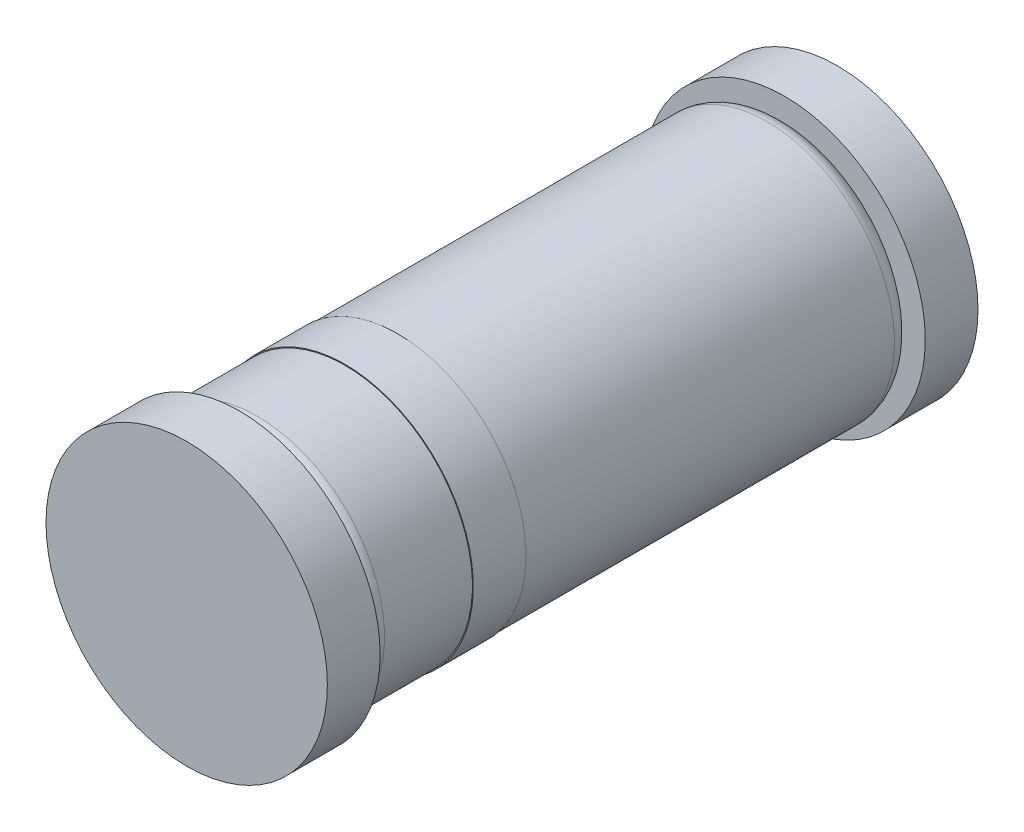
ISO-10303-21;
HEADER;
FILE_DESCRIPTION(('STEP AP214'),'2;1');
FILE_NAME('part.step','',(''),(''),'','','');
FILE_SCHEMA(('AUTOMOTIVE_DESIGN { 1 0 10303 214 1 1 1 1 }'));
ENDSEC;
DATA;
#1=APPLICATION_CONTEXT('core data for automotive mechanical design processes');
#2=APPLICATION_PROTOCOL_DEFINITION('international standard','automotive_design',2000,#1);
#3=PRODUCT_CONTEXT('',#1,'mechanical');
#4=PRODUCT('Part','Part','',(#3));
#5=PRODUCT_RELATED_PRODUCT_CATEGORY('part','',(#4));
#6=PRODUCT_DEFINITION_FORMATION('','',#4);
#7=PRODUCT_DEFINITION_CONTEXT('part definition',#1,'design');
#8=PRODUCT_DEFINITION('design','',#6,#7);
#9=PRODUCT_DEFINITION_SHAPE('','',#8);
#10=(LENGTH_UNIT() NAMED_UNIT(*) SI_UNIT(.MILLI.,.METRE.));
#11=(NAMED_UNIT(*) PLANE_ANGLE_UNIT() SI_UNIT($,.RADIAN.));
#12=(NAMED_UNIT(*) SI_UNIT($,.STERADIAN.) SOLID_ANGLE_UNIT());
#13=UNCERTAINTY_MEASURE_WITH_UNIT(LENGTH_MEASURE(1.E-05),#10,'distance_accuracy_value','');
#14=(GEOMETRIC_REPRESENTATION_CONTEXT(3) GLOBAL_UNCERTAINTY_ASSIGNED_CONTEXT((#13)) GLOBAL_UNIT_ASSIGNED_CONTEXT((#10,
#11,#12)) REPRESENTATION_CONTEXT('',''));
#15=CARTESIAN_POINT('',(0.,0.,0.));
#16=DIRECTION('',(0.,0.,1.));
#17=DIRECTION('',(1.,0.,0.));
#18=AXIS2_PLACEMENT_3D('',#15,#16,#17);
#19=CARTESIAN_POINT('',(0.,0.,-3.4));
#20=DIRECTION('',(0.,0.,1.));
#21=DIRECTION('',(1.,0.,0.));
#22=AXIS2_PLACEMENT_3D('',#19,#20,#21);
#23=PLANE('',#22);
#24=CARTESIAN_POINT('',(0.,0.,-3.4));
#25=DIRECTION('',(0.,0.,-1.));
#26=DIRECTION('',(-1.,0.,0.));
#27=AXIS2_PLACEMENT_3D('',#24,#25,#26);
#28=CIRCLE('',#27,0.8);
#29=CARTESIAN_POINT('',(-0.8,0.,-3.4));
#30=VERTEX_POINT('',#29);
#31=EDGE_CURVE('P0_E17',#30,#30,#28,.T.);
#32=ORIENTED_EDGE('',*,*,#31,.F.);
#33=EDGE_LOOP('',(#32));
#34=FACE_BOUND('',#33,.T.);
#35=ADVANCED_FACE('P0_F14',(#34),#23,.T.);
#36=CARTESIAN_POINT('',(0.,0.,-3.4));
#37=DIRECTION('',(0.,0.,-1.));
#38=DIRECTION('',(-1.,0.,0.));
#39=AXIS2_PLACEMENT_3D('',#36,#37,#38);
#40=CYLINDRICAL_SURFACE('',#39,0.8);
#41=ORIENTED_EDGE('',*,*,#31,.T.);
#42=EDGE_LOOP('',(#41));
#43=FACE_BOUND('',#42,.T.);
#44=CARTESIAN_POINT('',(0.,0.,-3.7));
#45=DIRECTION('',(0.,0.,-1.));
#46=DIRECTION('',(-1.,0.,0.));
#47=AXIS2_PLACEMENT_3D('',#44,#45,#46);
#48=CIRCLE('',#47,0.8);
#49=CARTESIAN_POINT('',(-0.8,0.,-3.7));
#50=VERTEX_POINT('',#49);
#51=EDGE_CURVE('P0_E9',#50,#50,#48,.F.);
#52=ORIENTED_EDGE('',*,*,#51,.T.);
#53=EDGE_LOOP('',(#52));
#54=FACE_BOUND('',#53,.T.);
#55=ADVANCED_FACE('P0_F26',(#43,#54),#40,.T.);
#56=CARTESIAN_POINT('',(0.,0.,-3.7));
#57=DIRECTION('',(0.,0.,1.));
#58=DIRECTION('',(1.,0.,0.));
#59=AXIS2_PLACEMENT_3D('',#56,#57,#58);
#60=PLANE('',#59);
#61=ORIENTED_EDGE('',*,*,#51,.F.);
#62=EDGE_LOOP('',(#61));
#63=FACE_BOUND('',#62,.T.);
#64=ADVANCED_FACE('P0_F33',(#63),#60,.F.);
#65=CLOSED_SHELL('',(#35,#55,#64));
#66=MANIFOLD_SOLID_BREP('P0_B1',#65);
#67=CARTESIAN_POINT('',(0.,0.,-0.3));
#68=DIRECTION('',(0.,0.,1.));
#69=DIRECTION('',(1.,0.,0.));
#70=AXIS2_PLACEMENT_3D('',#67,#68,#69);
#71=PLANE('',#70);
#72=CARTESIAN_POINT('',(0.,0.,-0.3));
#73=DIRECTION('',(0.,0.,-1.));
#74=DIRECTION('',(-1.,0.,0.));
#75=AXIS2_PLACEMENT_3D('',#72,#73,#74);
#76=CIRCLE('',#75,0.625);
#77=CARTESIAN_POINT('',(-0.625,0.,-0.3));
#78=VERTEX_POINT('',#77);
#79=EDGE_CURVE('P1_E66',#78,#78,#76,.T.);
#80=ORIENTED_EDGE('',*,*,#79,.F.);
#81=EDGE_LOOP('',(#80));
#82=FACE_BOUND('',#81,.T.);
#83=ADVANCED_FACE('P1_F15',(#82),#71,.T.);
#84=CARTESIAN_POINT('',(0.,0.,-3.4));
#85=DIRECTION('',(0.,0.,1.));
#86=DIRECTION('',(1.,0.,0.));
#87=AXIS2_PLACEMENT_3D('',#84,#85,#86);
#88=PLANE('',#87);
#89=CARTESIAN_POINT('',(0.,0.,-3.4));
#90=DIRECTION('',(0.,0.,1.));
#91=DIRECTION('',(-1.,0.,0.));
#92=AXIS2_PLACEMENT_3D('',#89,#90,#91);
#93=CIRCLE('',#92,0.625);
#94=CARTESIAN_POINT('',(-0.625,0.,-3.4));
#95=VERTEX_POINT('',#94);
#96=EDGE_CURVE('P1_E30',#95,#95,#93,.T.);
#97=ORIENTED_EDGE('',*,*,#96,.F.);
#98=EDGE_LOOP('',(#97));
#99=FACE_BOUND('',#98,.T.);
#100=ADVANCED_FACE('P1_F79',(#99),#88,.F.);
#101=CARTESIAN_POINT('',(0.,0.,-0.4));
#102=DIRECTION('',(0.,0.,1.));
#103=DIRECTION('',(1.,0.,0.));
#104=AXIS2_PLACEMENT_3D('',#101,#102,#103);
#105=TOROIDAL_SURFACE('',#104,0.625,0.1);
#106=ORIENTED_EDGE('',*,*,#79,.T.);
#107=EDGE_LOOP('',(#106));
#108=FACE_BOUND('',#107,.T.);
#109=CARTESIAN_POINT('',(0.,0.,-0.4));
#110=DIRECTION('',(0.,0.,-1.));
#111=DIRECTION('',(-1.,0.,0.));
#112=AXIS2_PLACEMENT_3D('',#109,#110,#111);
#113=CIRCLE('',#112,0.725);
#114=CARTESIAN_POINT('',(-0.725,0.,-0.4));
#115=VERTEX_POINT('',#114);
#116=EDGE_CURVE('P1_E25',#115,#115,#113,.T.);
#117=ORIENTED_EDGE('',*,*,#116,.F.);
#118=EDGE_LOOP('',(#117));
#119=FACE_BOUND('',#118,.T.);
#120=ADVANCED_FACE('P1_F47',(#108,#119),#105,.T.);
#121=CARTESIAN_POINT('',(0.,0.,-3.3));
#122=DIRECTION('',(0.,0.,-1.));
#123=DIRECTION('',(-1.,0.,0.));
#124=AXIS2_PLACEMENT_3D('',#121,#122,#123);
#125=TOROIDAL_SURFACE('',#124,0.625,0.1);
#126=ORIENTED_EDGE('',*,*,#96,.T.);
#127=EDGE_LOOP('',(#126));
#128=FACE_BOUND('',#127,.T.);
#129=CARTESIAN_POINT('',(0.,0.,-3.3));
#130=DIRECTION('',(0.,0.,-1.));
#131=DIRECTION('',(-1.,0.,0.));
#132=AXIS2_PLACEMENT_3D('',#129,#130,#131);
#133=CIRCLE('',#132,0.725);
#134=CARTESIAN_POINT('',(-0.725,0.,-3.3));
#135=VERTEX_POINT('',#134);
#136=EDGE_CURVE('P1_E10',#135,#135,#133,.F.);
#137=ORIENTED_EDGE('',*,*,#136,.F.);
#138=EDGE_LOOP('',(#137));
#139=FACE_BOUND('',#138,.T.);
#140=ADVANCED_FACE('P1_F42',(#128,#139),#125,.T.);
#141=CARTESIAN_POINT('',(0.,0.,-0.3));
#142=DIRECTION('',(0.,0.,-1.));
#143=DIRECTION('',(-1.,0.,0.));
#144=AXIS2_PLACEMENT_3D('',#141,#142,#143);
#145=CYLINDRICAL_SURFACE('',#144,0.725);
#146=ORIENTED_EDGE('',*,*,#136,.T.);
#147=EDGE_LOOP('',(#146));
#148=FACE_BOUND('',#147,.T.);
#149=ORIENTED_EDGE('',*,*,#116,.T.);
#150=EDGE_LOOP('',(#149));
#151=FACE_BOUND('',#150,.T.);
#152=ADVANCED_FACE('P1_F46',(#148,#151),#145,.T.);
#153=CLOSED_SHELL('',(#83,#100,#120,#140,#152));
#154=MANIFOLD_SOLID_BREP('P1_B1',#153);
#155=CARTESIAN_POINT('',(0.,0.,-0.9));
#156=DIRECTION('',(0.,0.,1.));
#157=DIRECTION('',(1.,0.,0.));
#158=AXIS2_PLACEMENT_3D('',#155,#156,#157);
#159=PLANE('',#158);
#160=CARTESIAN_POINT('',(0.,0.,-0.9));
#161=DIRECTION('',(0.,0.,-1.));
#162=DIRECTION('',(-1.,0.,0.));
#163=AXIS2_PLACEMENT_3D('',#160,#161,#162);
#164=CIRCLE('',#163,0.73);
#165=CARTESIAN_POINT('',(-0.73,0.,-0.9));
#166=VERTEX_POINT('',#165);
#167=EDGE_CURVE('P2_E18',#166,#166,#164,.T.);
#168=ORIENTED_EDGE('',*,*,#167,.F.);
#169=EDGE_LOOP('',(#168));
#170=FACE_BOUND('',#169,.T.);
#171=ADVANCED_FACE('P2_F15',(#170),#159,.T.);
#172=CARTESIAN_POINT('',(0.,0.,-0.9));
#173=DIRECTION('',(0.,0.,-1.));
#174=DIRECTION('',(-1.,0.,0.));
#175=AXIS2_PLACEMENT_3D('',#172,#173,#174);
#176=CYLINDRICAL_SURFACE('',#175,0.73);
#177=ORIENTED_EDGE('',*,*,#167,.T.);
#178=EDGE_LOOP('',(#177));
#179=FACE_BOUND('',#178,.T.);
#180=CARTESIAN_POINT('',(0.,0.,-1.2));
#181=DIRECTION('',(0.,0.,-1.));
#182=DIRECTION('',(-1.,0.,0.));
#183=AXIS2_PLACEMENT_3D('',#180,#181,#182);
#184=CIRCLE('',#183,0.73);
#185=CARTESIAN_POINT('',(-0.73,0.,-1.2));
#186=VERTEX_POINT('',#185);
#187=EDGE_CURVE('P2_E10',#186,#186,#184,.F.);
#188=ORIENTED_EDGE('',*,*,#187,.T.);
#189=EDGE_LOOP('',(#188));
#190=FACE_BOUND('',#189,.T.);
#191=ADVANCED_FACE('P2_F27',(#179,#190),#176,.T.);
#192=CARTESIAN_POINT('',(0.,0.,-1.2));
#193=DIRECTION('',(0.,0.,1.));
#194=DIRECTION('',(1.,0.,0.));
#195=AXIS2_PLACEMENT_3D('',#192,#193,#194);
#196=PLANE('',#195);
#197=ORIENTED_EDGE('',*,*,#187,.F.);
#198=EDGE_LOOP('',(#197));
#199=FACE_BOUND('',#198,.T.);
#200=ADVANCED_FACE('P2_F34',(#199),#196,.F.);
#201=CLOSED_SHELL('',(#171,#191,#200));
#202=MANIFOLD_SOLID_BREP('P2_B1',#201);
#203=CARTESIAN_POINT('',(0.,0.,0.));
#204=DIRECTION('',(0.,0.,1.));
#205=DIRECTION('',(1.,0.,0.));
#206=AXIS2_PLACEMENT_3D('',#203,#204,#205);
#207=PLANE('',#206);
#208=CARTESIAN_POINT('',(0.,0.,0.));
#209=DIRECTION('',(0.,0.,-1.));
#210=DIRECTION('',(-1.,0.,0.));
#211=AXIS2_PLACEMENT_3D('',#208,#209,#210);
#212=CIRCLE('',#211,0.8);
#213=CARTESIAN_POINT('',(-0.8,0.,0.));
#214=VERTEX_POINT('',#213);
#215=EDGE_CURVE('P3_E17',#214,#214,#212,.T.);
#216=ORIENTED_EDGE('',*,*,#215,.F.);
#217=EDGE_LOOP('',(#216));
#218=FACE_BOUND('',#217,.T.);
#219=ADVANCED_FACE('P3_F14',(#218),#207,.T.);
#220=CARTESIAN_POINT('',(0.,0.,0.));
#221=DIRECTION('',(0.,0.,-1.));
#222=DIRECTION('',(-1.,0.,0.));
#223=AXIS2_PLACEMENT_3D('',#220,#221,#222);
#224=CYLINDRICAL_SURFACE('',#223,0.8);
#225=ORIENTED_EDGE('',*,*,#215,.T.);
#226=EDGE_LOOP('',(#225));
#227=FACE_BOUND('',#226,.T.);
#228=CARTESIAN_POINT('',(0.,0.,-0.3));
#229=DIRECTION('',(0.,0.,-1.));
#230=DIRECTION('',(-1.,0.,0.));
#231=AXIS2_PLACEMENT_3D('',#228,#229,#230);
#232=CIRCLE('',#231,0.8);
#233=CARTESIAN_POINT('',(-0.8,0.,-0.3));
#234=VERTEX_POINT('',#233);
#235=EDGE_CURVE('P3_E9',#234,#234,#232,.F.);
#236=ORIENTED_EDGE('',*,*,#235,.T.);
#237=EDGE_LOOP('',(#236));
#238=FACE_BOUND('',#237,.T.);
#239=ADVANCED_FACE('P3_F26',(#227,#238),#224,.T.);
#240=CARTESIAN_POINT('',(0.,0.,-0.3));
#241=DIRECTION('',(0.,0.,1.));
#242=DIRECTION('',(1.,0.,0.));
#243=AXIS2_PLACEMENT_3D('',#240,#241,#242);
#244=PLANE('',#243);
#245=ORIENTED_EDGE('',*,*,#235,.F.);
#246=EDGE_LOOP('',(#245));
#247=FACE_BOUND('',#246,.T.);
#248=ADVANCED_FACE('P3_F33',(#247),#244,.F.);
#249=CLOSED_SHELL('',(#219,#239,#248));
#250=MANIFOLD_SOLID_BREP('P3_B1',#249);
#251=ADVANCED_BREP_SHAPE_REPRESENTATION('',(#18,#66,#154,#202,#250),#14);
#252=SHAPE_DEFINITION_REPRESENTATION(#9,#251);
ENDSEC;
END-ISO-10303-21;
